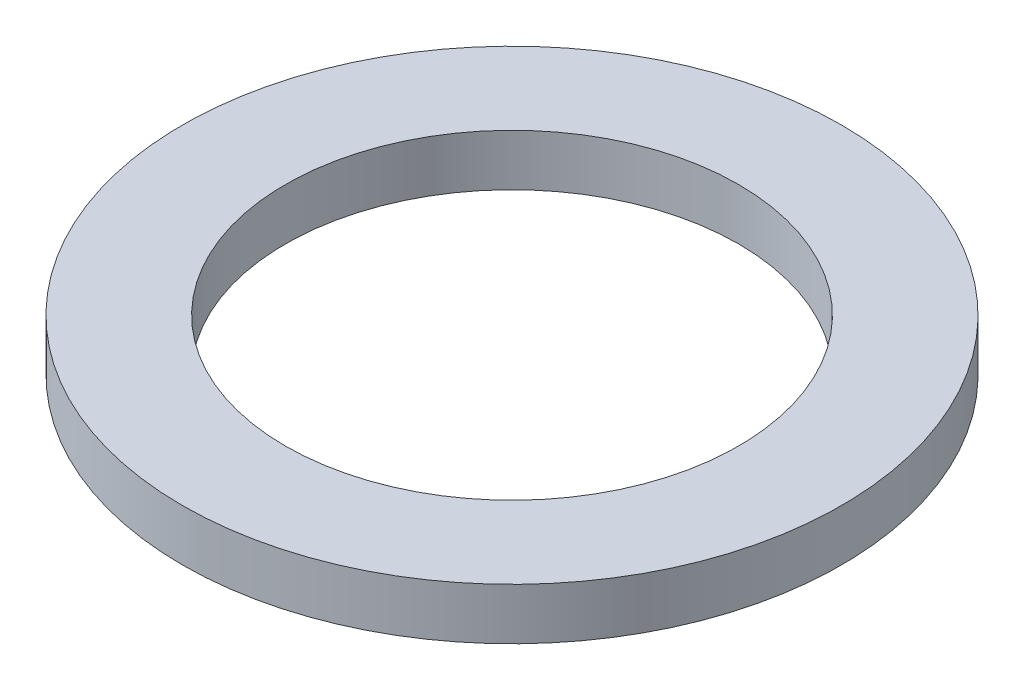
ISO-10303-21;
HEADER;
FILE_DESCRIPTION(('STEP AP214'),'2;1');
FILE_NAME('part.step','',(''),(''),'','','');
FILE_SCHEMA(('AUTOMOTIVE_DESIGN { 1 0 10303 214 1 1 1 1 }'));
ENDSEC;
DATA;
#1=APPLICATION_CONTEXT('core data for automotive mechanical design processes');
#2=APPLICATION_PROTOCOL_DEFINITION('international standard','automotive_design',2000,#1);
#3=PRODUCT_CONTEXT('',#1,'mechanical');
#4=PRODUCT('Part','Part','',(#3));
#5=PRODUCT_RELATED_PRODUCT_CATEGORY('part','',(#4));
#6=PRODUCT_DEFINITION_FORMATION('','',#4);
#7=PRODUCT_DEFINITION_CONTEXT('part definition',#1,'design');
#8=PRODUCT_DEFINITION('design','',#6,#7);
#9=PRODUCT_DEFINITION_SHAPE('','',#8);
#10=(LENGTH_UNIT() NAMED_UNIT(*) SI_UNIT(.MILLI.,.METRE.));
#11=(NAMED_UNIT(*) PLANE_ANGLE_UNIT() SI_UNIT($,.RADIAN.));
#12=(NAMED_UNIT(*) SI_UNIT($,.STERADIAN.) SOLID_ANGLE_UNIT());
#13=UNCERTAINTY_MEASURE_WITH_UNIT(LENGTH_MEASURE(1.E-05),#10,'distance_accuracy_value','');
#14=(GEOMETRIC_REPRESENTATION_CONTEXT(3) GLOBAL_UNCERTAINTY_ASSIGNED_CONTEXT((#13)) GLOBAL_UNIT_ASSIGNED_CONTEXT((#10,
#11,#12)) REPRESENTATION_CONTEXT('',''));
#15=CARTESIAN_POINT('',(0.,0.,0.));
#16=DIRECTION('',(0.,0.,1.));
#17=DIRECTION('',(1.,0.,0.));
#18=AXIS2_PLACEMENT_3D('',#15,#16,#17);
#19=CARTESIAN_POINT('',(0.,0.25,0.));
#20=DIRECTION('',(0.,1.,0.));
#21=DIRECTION('',(0.,0.,1.));
#22=AXIS2_PLACEMENT_3D('',#19,#20,#21);
#23=PLANE('',#22);
#24=CARTESIAN_POINT('',(0.,0.25,0.));
#25=DIRECTION('',(0.,1.,0.));
#26=DIRECTION('',(0.,0.,1.));
#27=AXIS2_PLACEMENT_3D('',#24,#25,#26);
#28=CIRCLE('',#27,1.6);
#29=CARTESIAN_POINT('',(0.,0.25,1.6));
#30=VERTEX_POINT('',#29);
#31=EDGE_CURVE('E10',#30,#30,#28,.T.);
#32=ORIENTED_EDGE('',*,*,#31,.T.);
#33=EDGE_LOOP('',(#32));
#34=FACE_BOUND('',#33,.T.);
#35=CARTESIAN_POINT('',(0.,0.25,0.));
#36=DIRECTION('',(0.,1.,0.));
#37=DIRECTION('',(0.,0.,1.));
#38=AXIS2_PLACEMENT_3D('',#35,#36,#37);
#39=CIRCLE('',#38,1.1);
#40=CARTESIAN_POINT('',(0.,0.25,1.1));
#41=VERTEX_POINT('',#40);
#42=EDGE_CURVE('E43',#41,#41,#39,.T.);
#43=ORIENTED_EDGE('',*,*,#42,.F.);
#44=EDGE_LOOP('',(#43));
#45=FACE_BOUND('',#44,.T.);
#46=ADVANCED_FACE('F32',(#34,#45),#23,.T.);
#47=CARTESIAN_POINT('',(0.,0.,0.));
#48=DIRECTION('',(0.,1.,0.));
#49=DIRECTION('',(0.,0.,1.));
#50=AXIS2_PLACEMENT_3D('',#47,#48,#49);
#51=PLANE('',#50);
#52=CARTESIAN_POINT('',(0.,0.,0.));
#53=DIRECTION('',(0.,1.,0.));
#54=DIRECTION('',(0.,0.,1.));
#55=AXIS2_PLACEMENT_3D('',#52,#53,#54);
#56=CIRCLE('',#55,1.6);
#57=CARTESIAN_POINT('',(0.,0.,1.6));
#58=VERTEX_POINT('',#57);
#59=EDGE_CURVE('E36',#58,#58,#56,.T.);
#60=ORIENTED_EDGE('',*,*,#59,.F.);
#61=EDGE_LOOP('',(#60));
#62=FACE_BOUND('',#61,.T.);
#63=CARTESIAN_POINT('',(0.,0.,0.));
#64=DIRECTION('',(0.,1.,0.));
#65=DIRECTION('',(0.,0.,1.));
#66=AXIS2_PLACEMENT_3D('',#63,#64,#65);
#67=CIRCLE('',#66,1.1);
#68=CARTESIAN_POINT('',(0.,0.,1.1));
#69=VERTEX_POINT('',#68);
#70=EDGE_CURVE('E45',#69,#69,#67,.T.);
#71=ORIENTED_EDGE('',*,*,#70,.T.);
#72=EDGE_LOOP('',(#71));
#73=FACE_BOUND('',#72,.T.);
#74=ADVANCED_FACE('F55',(#62,#73),#51,.F.);
#75=CARTESIAN_POINT('',(0.,0.25,0.));
#76=DIRECTION('',(0.,-1.,0.));
#77=DIRECTION('',(0.,0.,-1.));
#78=AXIS2_PLACEMENT_3D('',#75,#76,#77);
#79=CYLINDRICAL_SURFACE('',#78,1.6);
#80=ORIENTED_EDGE('',*,*,#31,.F.);
#81=EDGE_LOOP('',(#80));
#82=FACE_BOUND('',#81,.T.);
#83=ORIENTED_EDGE('',*,*,#59,.T.);
#84=EDGE_LOOP('',(#83));
#85=FACE_BOUND('',#84,.T.);
#86=ADVANCED_FACE('F34',(#82,#85),#79,.T.);
#87=CARTESIAN_POINT('',(0.,0.25,0.));
#88=DIRECTION('',(0.,-1.,0.));
#89=DIRECTION('',(0.,0.,-1.));
#90=AXIS2_PLACEMENT_3D('',#87,#88,#89);
#91=CYLINDRICAL_SURFACE('',#90,1.1);
#92=ORIENTED_EDGE('',*,*,#42,.T.);
#93=EDGE_LOOP('',(#92));
#94=FACE_BOUND('',#93,.T.);
#95=ORIENTED_EDGE('',*,*,#70,.F.);
#96=EDGE_LOOP('',(#95));
#97=FACE_BOUND('',#96,.T.);
#98=ADVANCED_FACE('F51',(#94,#97),#91,.F.);
#99=CLOSED_SHELL('',(#46,#74,#86,#98));
#100=MANIFOLD_SOLID_BREP('B2',#99);
#101=ADVANCED_BREP_SHAPE_REPRESENTATION('',(#18,#100),#14);
#102=SHAPE_DEFINITION_REPRESENTATION(#9,#101);
ENDSEC;
END-ISO-10303-21;
